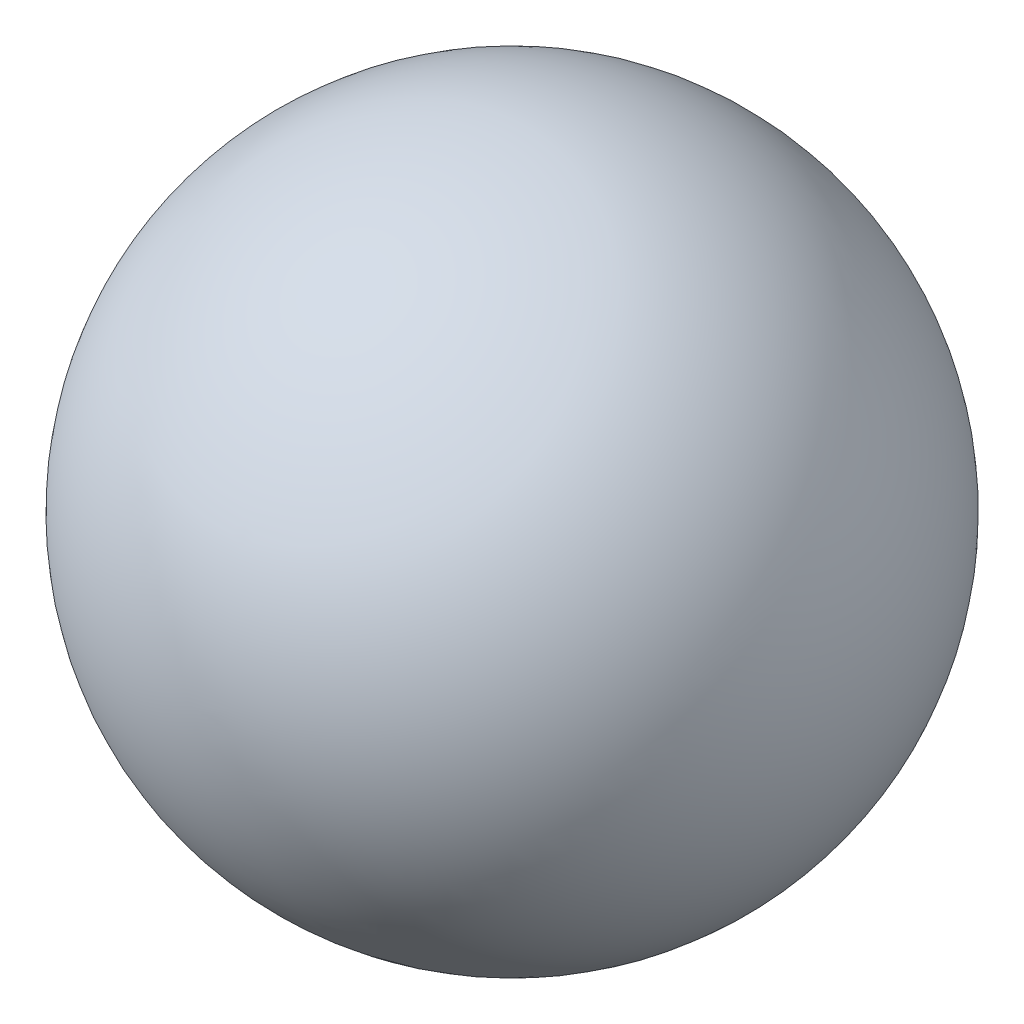
ISO-10303-21;
HEADER;
FILE_DESCRIPTION(('STEP AP214'),'2;1');
FILE_NAME('part.step','',(''),(''),'','','');
FILE_SCHEMA(('AUTOMOTIVE_DESIGN { 1 0 10303 214 1 1 1 1 }'));
ENDSEC;
DATA;
#1=APPLICATION_CONTEXT('core data for automotive mechanical design processes');
#2=APPLICATION_PROTOCOL_DEFINITION('international standard','automotive_design',2000,#1);
#3=PRODUCT_CONTEXT('',#1,'mechanical');
#4=PRODUCT('Part','Part','',(#3));
#5=PRODUCT_RELATED_PRODUCT_CATEGORY('part','',(#4));
#6=PRODUCT_DEFINITION_FORMATION('','',#4);
#7=PRODUCT_DEFINITION_CONTEXT('part definition',#1,'design');
#8=PRODUCT_DEFINITION('design','',#6,#7);
#9=PRODUCT_DEFINITION_SHAPE('','',#8);
#10=(LENGTH_UNIT() NAMED_UNIT(*) SI_UNIT(.MILLI.,.METRE.));
#11=(NAMED_UNIT(*) PLANE_ANGLE_UNIT() SI_UNIT($,.RADIAN.));
#12=(NAMED_UNIT(*) SI_UNIT($,.STERADIAN.) SOLID_ANGLE_UNIT());
#13=UNCERTAINTY_MEASURE_WITH_UNIT(LENGTH_MEASURE(1.E-05),#10,'distance_accuracy_value','');
#14=(GEOMETRIC_REPRESENTATION_CONTEXT(3) GLOBAL_UNCERTAINTY_ASSIGNED_CONTEXT((#13)) GLOBAL_UNIT_ASSIGNED_CONTEXT((#10,
#11,#12)) REPRESENTATION_CONTEXT('',''));
#15=CARTESIAN_POINT('',(0.,0.,0.));
#16=DIRECTION('',(0.,0.,1.));
#17=DIRECTION('',(1.,0.,0.));
#18=AXIS2_PLACEMENT_3D('',#15,#16,#17);
#19=CARTESIAN_POINT('',(64.16,56.3324992532804,40.5049406477675));
#20=DIRECTION('',(0.,0.811906363998105,0.583787680667704));
#21=DIRECTION('',(0.173648177666933,-0.57491863403457,0.799571681985285));
#22=AXIS2_PLACEMENT_3D('',#19,#20,#21);
#23=SPHERICAL_SURFACE('',#22,7.15);
#24=CARTESIAN_POINT('',(64.16,62.1376297558669,44.6790225645416));
#25=VERTEX_POINT('',#24);
#26=VERTEX_LOOP('',#25);
#27=FACE_BOUND('',#26,.T.);
#28=CARTESIAN_POINT('',(64.16,50.527368750694,36.3308587309934));
#29=VERTEX_POINT('',#28);
#30=VERTEX_LOOP('',#29);
#31=FACE_BOUND('',#30,.T.);
#32=ADVANCED_FACE('F16',(#27,#31),#23,.T.);
#33=CLOSED_SHELL('',(#32));
#34=MANIFOLD_SOLID_BREP('B1',#33);
#35=ADVANCED_BREP_SHAPE_REPRESENTATION('',(#18,#34),#14);
#36=SHAPE_DEFINITION_REPRESENTATION(#9,#35);
ENDSEC;
END-ISO-10303-21;
